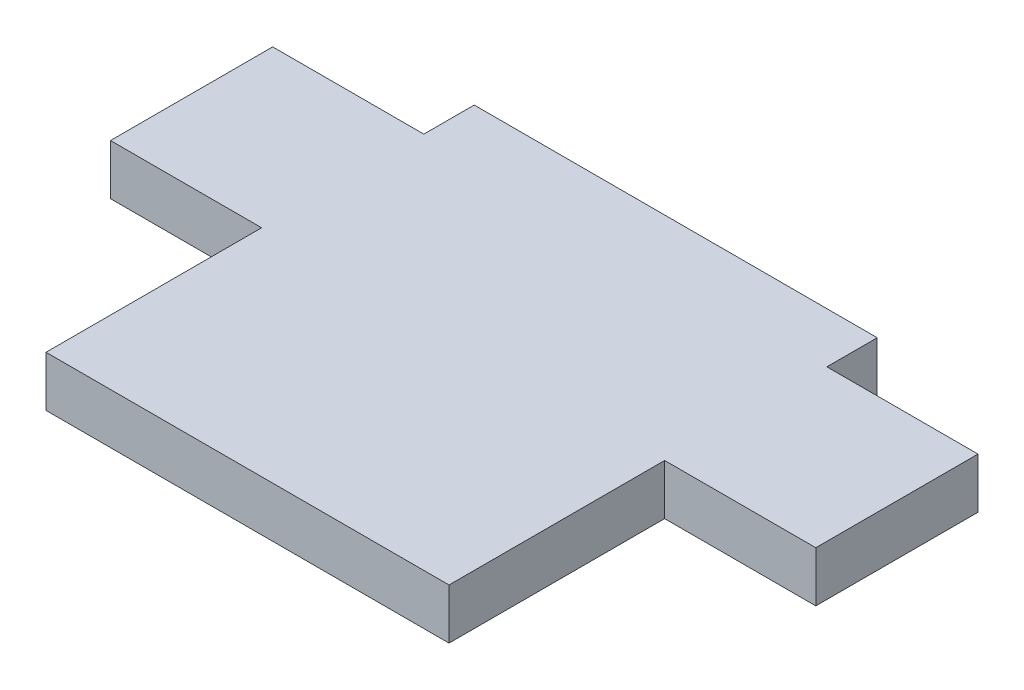
ISO-10303-21;
HEADER;
FILE_DESCRIPTION(('STEP AP214'),'2;1');
FILE_NAME('part.step','',(''),(''),'','','');
FILE_SCHEMA(('AUTOMOTIVE_DESIGN { 1 0 10303 214 1 1 1 1 }'));
ENDSEC;
DATA;
#1=APPLICATION_CONTEXT('core data for automotive mechanical design processes');
#2=APPLICATION_PROTOCOL_DEFINITION('international standard','automotive_design',2000,#1);
#3=PRODUCT_CONTEXT('',#1,'mechanical');
#4=PRODUCT('Part','Part','',(#3));
#5=PRODUCT_RELATED_PRODUCT_CATEGORY('part','',(#4));
#6=PRODUCT_DEFINITION_FORMATION('','',#4);
#7=PRODUCT_DEFINITION_CONTEXT('part definition',#1,'design');
#8=PRODUCT_DEFINITION('design','',#6,#7);
#9=PRODUCT_DEFINITION_SHAPE('','',#8);
#10=(LENGTH_UNIT() NAMED_UNIT(*) SI_UNIT(.MILLI.,.METRE.));
#11=(NAMED_UNIT(*) PLANE_ANGLE_UNIT() SI_UNIT($,.RADIAN.));
#12=(NAMED_UNIT(*) SI_UNIT($,.STERADIAN.) SOLID_ANGLE_UNIT());
#13=UNCERTAINTY_MEASURE_WITH_UNIT(LENGTH_MEASURE(1.E-05),#10,'distance_accuracy_value','');
#14=(GEOMETRIC_REPRESENTATION_CONTEXT(3) GLOBAL_UNCERTAINTY_ASSIGNED_CONTEXT((#13)) GLOBAL_UNIT_ASSIGNED_CONTEXT((#10,
#11,#12)) REPRESENTATION_CONTEXT('',''));
#15=CARTESIAN_POINT('',(0.,0.,0.));
#16=DIRECTION('',(0.,0.,1.));
#17=DIRECTION('',(1.,0.,0.));
#18=AXIS2_PLACEMENT_3D('',#15,#16,#17);
#19=CARTESIAN_POINT('',(0.,3.175,-10.2235));
#20=DIRECTION('',(-1.,0.,0.));
#21=DIRECTION('',(0.,0.,1.));
#22=AXIS2_PLACEMENT_3D('',#19,#20,#21);
#23=PLANE('',#22);
#24=DIRECTION('',(0.,0.,-1.));
#25=VECTOR('',#24,1.);
#26=CARTESIAN_POINT('',(0.,0.,-10.2235));
#27=LINE('',#26,#25);
#28=CARTESIAN_POINT('',(0.,0.,-10.2235));
#29=VERTEX_POINT('',#28);
#30=CARTESIAN_POINT('',(0.,0.,-13.3985));
#31=VERTEX_POINT('',#30);
#32=EDGE_CURVE('E155',#29,#31,#27,.T.);
#33=ORIENTED_EDGE('',*,*,#32,.T.);
#34=DIRECTION('',(0.,-1.,0.));
#35=VECTOR('',#34,1.);
#36=CARTESIAN_POINT('',(0.,3.175,-13.3985));
#37=LINE('',#36,#35);
#38=CARTESIAN_POINT('',(0.,3.175,-13.3985));
#39=VERTEX_POINT('',#38);
#40=EDGE_CURVE('E11',#39,#31,#37,.T.);
#41=ORIENTED_EDGE('',*,*,#40,.F.);
#42=DIRECTION('',(0.,0.,-1.));
#43=VECTOR('',#42,1.);
#44=CARTESIAN_POINT('',(0.,3.175,-10.2235));
#45=LINE('',#44,#43);
#46=CARTESIAN_POINT('',(0.,3.175,-10.2235));
#47=VERTEX_POINT('',#46);
#48=EDGE_CURVE('E177',#47,#39,#45,.T.);
#49=ORIENTED_EDGE('',*,*,#48,.F.);
#50=DIRECTION('',(0.,-1.,0.));
#51=VECTOR('',#50,1.);
#52=CARTESIAN_POINT('',(0.,3.175,-10.2235));
#53=LINE('',#52,#51);
#54=EDGE_CURVE('E151',#47,#29,#53,.T.);
#55=ORIENTED_EDGE('',*,*,#54,.T.);
#56=EDGE_LOOP('',(#33,#41,#49,#55));
#57=FACE_BOUND('',#56,.T.);
#58=ADVANCED_FACE('F35',(#57),#23,.F.);
#59=CARTESIAN_POINT('',(0.,3.175,-13.3985));
#60=DIRECTION('',(0.,0.,1.));
#61=DIRECTION('',(1.,0.,0.));
#62=AXIS2_PLACEMENT_3D('',#59,#60,#61);
#63=PLANE('',#62);
#64=DIRECTION('',(-1.,0.,0.));
#65=VECTOR('',#64,1.);
#66=CARTESIAN_POINT('',(0.,0.,-13.3985));
#67=LINE('',#66,#65);
#68=CARTESIAN_POINT('',(-25.4,0.,-13.3985));
#69=VERTEX_POINT('',#68);
#70=EDGE_CURVE('E158',#31,#69,#67,.T.);
#71=ORIENTED_EDGE('',*,*,#70,.T.);
#72=DIRECTION('',(0.,-1.,0.));
#73=VECTOR('',#72,1.);
#74=CARTESIAN_POINT('',(-25.4,3.175,-13.3985));
#75=LINE('',#74,#73);
#76=CARTESIAN_POINT('',(-25.4,3.175,-13.3985));
#77=VERTEX_POINT('',#76);
#78=EDGE_CURVE('E43',#77,#69,#75,.T.);
#79=ORIENTED_EDGE('',*,*,#78,.F.);
#80=DIRECTION('',(-1.,0.,0.));
#81=VECTOR('',#80,1.);
#82=CARTESIAN_POINT('',(0.,3.175,-13.3985));
#83=LINE('',#82,#81);
#84=EDGE_CURVE('E106',#39,#77,#83,.T.);
#85=ORIENTED_EDGE('',*,*,#84,.F.);
#86=ORIENTED_EDGE('',*,*,#40,.T.);
#87=EDGE_LOOP('',(#71,#79,#85,#86));
#88=FACE_BOUND('',#87,.T.);
#89=ADVANCED_FACE('F255',(#88),#63,.F.);
#90=CARTESIAN_POINT('',(-25.4,3.175,-13.3985));
#91=DIRECTION('',(1.,0.,0.));
#92=DIRECTION('',(0.,0.,-1.));
#93=AXIS2_PLACEMENT_3D('',#90,#91,#92);
#94=PLANE('',#93);
#95=DIRECTION('',(0.,0.,1.));
#96=VECTOR('',#95,1.);
#97=CARTESIAN_POINT('',(-25.4,0.,-13.3985));
#98=LINE('',#97,#96);
#99=CARTESIAN_POINT('',(-25.4,0.,-10.2235));
#100=VERTEX_POINT('',#99);
#101=EDGE_CURVE('E160',#69,#100,#98,.T.);
#102=ORIENTED_EDGE('',*,*,#101,.T.);
#103=DIRECTION('',(0.,-1.,0.));
#104=VECTOR('',#103,1.);
#105=CARTESIAN_POINT('',(-25.4,3.175,-10.2235));
#106=LINE('',#105,#104);
#107=CARTESIAN_POINT('',(-25.4,3.175,-10.2235));
#108=VERTEX_POINT('',#107);
#109=EDGE_CURVE('E196',#108,#100,#106,.T.);
#110=ORIENTED_EDGE('',*,*,#109,.F.);
#111=DIRECTION('',(0.,0.,1.));
#112=VECTOR('',#111,1.);
#113=CARTESIAN_POINT('',(-25.4,3.175,-13.3985));
#114=LINE('',#113,#112);
#115=EDGE_CURVE('E204',#77,#108,#114,.T.);
#116=ORIENTED_EDGE('',*,*,#115,.F.);
#117=ORIENTED_EDGE('',*,*,#78,.T.);
#118=EDGE_LOOP('',(#102,#110,#116,#117));
#119=FACE_BOUND('',#118,.T.);
#120=ADVANCED_FACE('F202',(#119),#94,.F.);
#121=CARTESIAN_POINT('',(-25.4,3.175,-10.2235));
#122=DIRECTION('',(0.,0.,1.));
#123=DIRECTION('',(1.,0.,0.));
#124=AXIS2_PLACEMENT_3D('',#121,#122,#123);
#125=PLANE('',#124);
#126=DIRECTION('',(-1.,0.,0.));
#127=VECTOR('',#126,1.);
#128=CARTESIAN_POINT('',(-25.4,0.,-10.2235));
#129=LINE('',#128,#127);
#130=CARTESIAN_POINT('',(-34.925,0.,-10.2235));
#131=VERTEX_POINT('',#130);
#132=EDGE_CURVE('E162',#100,#131,#129,.T.);
#133=ORIENTED_EDGE('',*,*,#132,.T.);
#134=DIRECTION('',(0.,-1.,0.));
#135=VECTOR('',#134,1.);
#136=CARTESIAN_POINT('',(-34.925,3.175,-10.2235));
#137=LINE('',#136,#135);
#138=CARTESIAN_POINT('',(-34.925,3.175,-10.2235));
#139=VERTEX_POINT('',#138);
#140=EDGE_CURVE('E193',#139,#131,#137,.T.);
#141=ORIENTED_EDGE('',*,*,#140,.F.);
#142=DIRECTION('',(-1.,0.,0.));
#143=VECTOR('',#142,1.);
#144=CARTESIAN_POINT('',(-25.4,3.175,-10.2235));
#145=LINE('',#144,#143);
#146=EDGE_CURVE('E222',#108,#139,#145,.T.);
#147=ORIENTED_EDGE('',*,*,#146,.F.);
#148=ORIENTED_EDGE('',*,*,#109,.T.);
#149=EDGE_LOOP('',(#133,#141,#147,#148));
#150=FACE_BOUND('',#149,.T.);
#151=ADVANCED_FACE('F213',(#150),#125,.F.);
#152=CARTESIAN_POINT('',(-34.925,3.175,-10.2235));
#153=DIRECTION('',(1.,0.,0.));
#154=DIRECTION('',(0.,0.,-1.));
#155=AXIS2_PLACEMENT_3D('',#152,#153,#154);
#156=PLANE('',#155);
#157=DIRECTION('',(0.,0.,1.));
#158=VECTOR('',#157,1.);
#159=CARTESIAN_POINT('',(-34.925,0.,-10.2235));
#160=LINE('',#159,#158);
#161=CARTESIAN_POINT('',(-34.925,0.,0.));
#162=VERTEX_POINT('',#161);
#163=EDGE_CURVE('E164',#131,#162,#160,.T.);
#164=ORIENTED_EDGE('',*,*,#163,.T.);
#165=DIRECTION('',(0.,-1.,0.));
#166=VECTOR('',#165,1.);
#167=CARTESIAN_POINT('',(-34.925,3.175,0.));
#168=LINE('',#167,#166);
#169=CARTESIAN_POINT('',(-34.925,3.175,0.));
#170=VERTEX_POINT('',#169);
#171=EDGE_CURVE('E190',#170,#162,#168,.T.);
#172=ORIENTED_EDGE('',*,*,#171,.F.);
#173=DIRECTION('',(0.,0.,1.));
#174=VECTOR('',#173,1.);
#175=CARTESIAN_POINT('',(-34.925,3.175,-10.2235));
#176=LINE('',#175,#174);
#177=EDGE_CURVE('E219',#139,#170,#176,.T.);
#178=ORIENTED_EDGE('',*,*,#177,.F.);
#179=ORIENTED_EDGE('',*,*,#140,.T.);
#180=EDGE_LOOP('',(#164,#172,#178,#179));
#181=FACE_BOUND('',#180,.T.);
#182=ADVANCED_FACE('F217',(#181),#156,.F.);
#183=CARTESIAN_POINT('',(-34.925,3.175,0.));
#184=DIRECTION('',(0.,0.,-1.));
#185=DIRECTION('',(-1.,0.,0.));
#186=AXIS2_PLACEMENT_3D('',#183,#184,#185);
#187=PLANE('',#186);
#188=DIRECTION('',(1.,0.,0.));
#189=VECTOR('',#188,1.);
#190=CARTESIAN_POINT('',(-34.925,0.,0.));
#191=LINE('',#190,#189);
#192=CARTESIAN_POINT('',(-25.4,0.,0.));
#193=VERTEX_POINT('',#192);
#194=EDGE_CURVE('E166',#162,#193,#191,.T.);
#195=ORIENTED_EDGE('',*,*,#194,.T.);
#196=DIRECTION('',(0.,-1.,0.));
#197=VECTOR('',#196,1.);
#198=CARTESIAN_POINT('',(-25.4,3.175,0.));
#199=LINE('',#198,#197);
#200=CARTESIAN_POINT('',(-25.4,3.175,0.));
#201=VERTEX_POINT('',#200);
#202=EDGE_CURVE('E187',#201,#193,#199,.T.);
#203=ORIENTED_EDGE('',*,*,#202,.F.);
#204=DIRECTION('',(1.,0.,0.));
#205=VECTOR('',#204,1.);
#206=CARTESIAN_POINT('',(-34.925,3.175,0.));
#207=LINE('',#206,#205);
#208=EDGE_CURVE('E221',#170,#201,#207,.T.);
#209=ORIENTED_EDGE('',*,*,#208,.F.);
#210=ORIENTED_EDGE('',*,*,#171,.T.);
#211=EDGE_LOOP('',(#195,#203,#209,#210));
#212=FACE_BOUND('',#211,.T.);
#213=ADVANCED_FACE('F268',(#212),#187,.F.);
#214=CARTESIAN_POINT('',(-25.4,3.175,0.));
#215=DIRECTION('',(1.,0.,0.));
#216=DIRECTION('',(0.,0.,-1.));
#217=AXIS2_PLACEMENT_3D('',#214,#215,#216);
#218=PLANE('',#217);
#219=DIRECTION('',(0.,0.,1.));
#220=VECTOR('',#219,1.);
#221=CARTESIAN_POINT('',(-25.4,0.,0.));
#222=LINE('',#221,#220);
#223=CARTESIAN_POINT('',(-25.4,0.,13.589));
#224=VERTEX_POINT('',#223);
#225=EDGE_CURVE('E168',#193,#224,#222,.T.);
#226=ORIENTED_EDGE('',*,*,#225,.T.);
#227=DIRECTION('',(0.,-1.,0.));
#228=VECTOR('',#227,1.);
#229=CARTESIAN_POINT('',(-25.4,3.175,13.589));
#230=LINE('',#229,#228);
#231=CARTESIAN_POINT('',(-25.4,3.175,13.589));
#232=VERTEX_POINT('',#231);
#233=EDGE_CURVE('E184',#232,#224,#230,.T.);
#234=ORIENTED_EDGE('',*,*,#233,.F.);
#235=DIRECTION('',(0.,0.,1.));
#236=VECTOR('',#235,1.);
#237=CARTESIAN_POINT('',(-25.4,3.175,0.));
#238=LINE('',#237,#236);
#239=EDGE_CURVE('E224',#201,#232,#238,.T.);
#240=ORIENTED_EDGE('',*,*,#239,.F.);
#241=ORIENTED_EDGE('',*,*,#202,.T.);
#242=EDGE_LOOP('',(#226,#234,#240,#241));
#243=FACE_BOUND('',#242,.T.);
#244=ADVANCED_FACE('F271',(#243),#218,.F.);
#245=CARTESIAN_POINT('',(-25.4,3.175,13.589));
#246=DIRECTION('',(0.,0.,-1.));
#247=DIRECTION('',(-1.,0.,0.));
#248=AXIS2_PLACEMENT_3D('',#245,#246,#247);
#249=PLANE('',#248);
#250=DIRECTION('',(1.,0.,0.));
#251=VECTOR('',#250,1.);
#252=CARTESIAN_POINT('',(-25.4,0.,13.589));
#253=LINE('',#252,#251);
#254=CARTESIAN_POINT('',(0.,0.,13.589));
#255=VERTEX_POINT('',#254);
#256=EDGE_CURVE('E170',#224,#255,#253,.T.);
#257=ORIENTED_EDGE('',*,*,#256,.T.);
#258=DIRECTION('',(0.,-1.,0.));
#259=VECTOR('',#258,1.);
#260=CARTESIAN_POINT('',(0.,3.175,13.589));
#261=LINE('',#260,#259);
#262=CARTESIAN_POINT('',(0.,3.175,13.589));
#263=VERTEX_POINT('',#262);
#264=EDGE_CURVE('E181',#263,#255,#261,.T.);
#265=ORIENTED_EDGE('',*,*,#264,.F.);
#266=DIRECTION('',(1.,0.,0.));
#267=VECTOR('',#266,1.);
#268=CARTESIAN_POINT('',(-25.4,3.175,13.589));
#269=LINE('',#268,#267);
#270=EDGE_CURVE('E230',#232,#263,#269,.T.);
#271=ORIENTED_EDGE('',*,*,#270,.F.);
#272=ORIENTED_EDGE('',*,*,#233,.T.);
#273=EDGE_LOOP('',(#257,#265,#271,#272));
#274=FACE_BOUND('',#273,.T.);
#275=ADVANCED_FACE('F236',(#274),#249,.F.);
#276=CARTESIAN_POINT('',(0.,3.175,13.589));
#277=DIRECTION('',(-1.,0.,0.));
#278=DIRECTION('',(0.,0.,1.));
#279=AXIS2_PLACEMENT_3D('',#276,#277,#278);
#280=PLANE('',#279);
#281=DIRECTION('',(0.,0.,-1.));
#282=VECTOR('',#281,1.);
#283=CARTESIAN_POINT('',(0.,0.,13.589));
#284=LINE('',#283,#282);
#285=CARTESIAN_POINT('',(0.,0.,0.));
#286=VERTEX_POINT('',#285);
#287=EDGE_CURVE('E172',#255,#286,#284,.T.);
#288=ORIENTED_EDGE('',*,*,#287,.T.);
#289=DIRECTION('',(0.,-1.,0.));
#290=VECTOR('',#289,1.);
#291=CARTESIAN_POINT('',(0.,3.175,0.));
#292=LINE('',#291,#290);
#293=CARTESIAN_POINT('',(0.,3.175,0.));
#294=VERTEX_POINT('',#293);
#295=EDGE_CURVE('E146',#294,#286,#292,.T.);
#296=ORIENTED_EDGE('',*,*,#295,.F.);
#297=DIRECTION('',(0.,0.,-1.));
#298=VECTOR('',#297,1.);
#299=CARTESIAN_POINT('',(0.,3.175,13.589));
#300=LINE('',#299,#298);
#301=EDGE_CURVE('E137',#263,#294,#300,.T.);
#302=ORIENTED_EDGE('',*,*,#301,.F.);
#303=ORIENTED_EDGE('',*,*,#264,.T.);
#304=EDGE_LOOP('',(#288,#296,#302,#303));
#305=FACE_BOUND('',#304,.T.);
#306=ADVANCED_FACE('F240',(#305),#280,.F.);
#307=CARTESIAN_POINT('',(0.,3.175,0.));
#308=DIRECTION('',(0.,0.,-1.));
#309=DIRECTION('',(-1.,0.,0.));
#310=AXIS2_PLACEMENT_3D('',#307,#308,#309);
#311=PLANE('',#310);
#312=DIRECTION('',(1.,0.,0.));
#313=VECTOR('',#312,1.);
#314=CARTESIAN_POINT('',(0.,0.,0.));
#315=LINE('',#314,#313);
#316=CARTESIAN_POINT('',(9.525,0.,0.));
#317=VERTEX_POINT('',#316);
#318=EDGE_CURVE('E145',#286,#317,#315,.T.);
#319=ORIENTED_EDGE('',*,*,#318,.T.);
#320=DIRECTION('',(0.,-1.,0.));
#321=VECTOR('',#320,1.);
#322=CARTESIAN_POINT('',(9.525,3.175,0.));
#323=LINE('',#322,#321);
#324=CARTESIAN_POINT('',(9.525,3.175,0.));
#325=VERTEX_POINT('',#324);
#326=EDGE_CURVE('E142',#325,#317,#323,.T.);
#327=ORIENTED_EDGE('',*,*,#326,.F.);
#328=DIRECTION('',(1.,0.,0.));
#329=VECTOR('',#328,1.);
#330=CARTESIAN_POINT('',(0.,3.175,0.));
#331=LINE('',#330,#329);
#332=EDGE_CURVE('E131',#294,#325,#331,.T.);
#333=ORIENTED_EDGE('',*,*,#332,.F.);
#334=ORIENTED_EDGE('',*,*,#295,.T.);
#335=EDGE_LOOP('',(#319,#327,#333,#334));
#336=FACE_BOUND('',#335,.T.);
#337=ADVANCED_FACE('F143',(#336),#311,.F.);
#338=CARTESIAN_POINT('',(9.525,3.175,0.));
#339=DIRECTION('',(-1.,0.,0.));
#340=DIRECTION('',(0.,0.,1.));
#341=AXIS2_PLACEMENT_3D('',#338,#339,#340);
#342=PLANE('',#341);
#343=DIRECTION('',(0.,0.,-1.));
#344=VECTOR('',#343,1.);
#345=CARTESIAN_POINT('',(9.525,0.,0.));
#346=LINE('',#345,#344);
#347=CARTESIAN_POINT('',(9.525,0.,-10.2235));
#348=VERTEX_POINT('',#347);
#349=EDGE_CURVE('E92',#317,#348,#346,.T.);
#350=ORIENTED_EDGE('',*,*,#349,.T.);
#351=DIRECTION('',(0.,-1.,0.));
#352=VECTOR('',#351,1.);
#353=CARTESIAN_POINT('',(9.525,3.175,-10.2235));
#354=LINE('',#353,#352);
#355=CARTESIAN_POINT('',(9.525,3.175,-10.2235));
#356=VERTEX_POINT('',#355);
#357=EDGE_CURVE('E147',#356,#348,#354,.T.);
#358=ORIENTED_EDGE('',*,*,#357,.F.);
#359=DIRECTION('',(0.,0.,-1.));
#360=VECTOR('',#359,1.);
#361=CARTESIAN_POINT('',(9.525,3.175,0.));
#362=LINE('',#361,#360);
#363=EDGE_CURVE('E135',#325,#356,#362,.T.);
#364=ORIENTED_EDGE('',*,*,#363,.F.);
#365=ORIENTED_EDGE('',*,*,#326,.T.);
#366=EDGE_LOOP('',(#350,#358,#364,#365));
#367=FACE_BOUND('',#366,.T.);
#368=ADVANCED_FACE('F149',(#367),#342,.F.);
#369=CARTESIAN_POINT('',(9.525,3.175,-10.2235));
#370=DIRECTION('',(0.,0.,1.));
#371=DIRECTION('',(1.,0.,0.));
#372=AXIS2_PLACEMENT_3D('',#369,#370,#371);
#373=PLANE('',#372);
#374=DIRECTION('',(-1.,0.,0.));
#375=VECTOR('',#374,1.);
#376=CARTESIAN_POINT('',(9.525,0.,-10.2235));
#377=LINE('',#376,#375);
#378=EDGE_CURVE('E98',#348,#29,#377,.T.);
#379=ORIENTED_EDGE('',*,*,#378,.T.);
#380=ORIENTED_EDGE('',*,*,#54,.F.);
#381=DIRECTION('',(-1.,0.,0.));
#382=VECTOR('',#381,1.);
#383=CARTESIAN_POINT('',(9.525,3.175,-10.2235));
#384=LINE('',#383,#382);
#385=EDGE_CURVE('E51',#356,#47,#384,.T.);
#386=ORIENTED_EDGE('',*,*,#385,.F.);
#387=ORIENTED_EDGE('',*,*,#357,.T.);
#388=EDGE_LOOP('',(#379,#380,#386,#387));
#389=FACE_BOUND('',#388,.T.);
#390=ADVANCED_FACE('F244',(#389),#373,.F.);
#391=CARTESIAN_POINT('',(0.,3.175,-13.3985));
#392=DIRECTION('',(0.,1.,0.));
#393=DIRECTION('',(0.,0.,1.));
#394=AXIS2_PLACEMENT_3D('',#391,#392,#393);
#395=PLANE('',#394);
#396=ORIENTED_EDGE('',*,*,#48,.T.);
#397=ORIENTED_EDGE('',*,*,#84,.T.);
#398=ORIENTED_EDGE('',*,*,#115,.T.);
#399=ORIENTED_EDGE('',*,*,#146,.T.);
#400=ORIENTED_EDGE('',*,*,#177,.T.);
#401=ORIENTED_EDGE('',*,*,#208,.T.);
#402=ORIENTED_EDGE('',*,*,#239,.T.);
#403=ORIENTED_EDGE('',*,*,#270,.T.);
#404=ORIENTED_EDGE('',*,*,#301,.T.);
#405=ORIENTED_EDGE('',*,*,#332,.T.);
#406=ORIENTED_EDGE('',*,*,#363,.T.);
#407=ORIENTED_EDGE('',*,*,#385,.T.);
#408=EDGE_LOOP('',(#396,#397,#398,#399,#400,#401,#402,#403,#404,#405,#406,#407));
#409=FACE_BOUND('',#408,.T.);
#410=ADVANCED_FACE('F133',(#409),#395,.T.);
#411=CARTESIAN_POINT('',(0.,0.,-13.3985));
#412=DIRECTION('',(0.,1.,0.));
#413=DIRECTION('',(0.,0.,1.));
#414=AXIS2_PLACEMENT_3D('',#411,#412,#413);
#415=PLANE('',#414);
#416=ORIENTED_EDGE('',*,*,#32,.F.);
#417=ORIENTED_EDGE('',*,*,#378,.F.);
#418=ORIENTED_EDGE('',*,*,#349,.F.);
#419=ORIENTED_EDGE('',*,*,#318,.F.);
#420=ORIENTED_EDGE('',*,*,#287,.F.);
#421=ORIENTED_EDGE('',*,*,#256,.F.);
#422=ORIENTED_EDGE('',*,*,#225,.F.);
#423=ORIENTED_EDGE('',*,*,#194,.F.);
#424=ORIENTED_EDGE('',*,*,#163,.F.);
#425=ORIENTED_EDGE('',*,*,#132,.F.);
#426=ORIENTED_EDGE('',*,*,#101,.F.);
#427=ORIENTED_EDGE('',*,*,#70,.F.);
#428=EDGE_LOOP('',(#416,#417,#418,#419,#420,#421,#422,#423,#424,#425,#426,#427));
#429=FACE_BOUND('',#428,.T.);
#430=ADVANCED_FACE('F208',(#429),#415,.F.);
#431=CLOSED_SHELL('',(#58,#89,#120,#151,#182,#213,#244,#275,#306,#337,#368,#390,#410,#430));
#432=MANIFOLD_SOLID_BREP('B2',#431);
#433=ADVANCED_BREP_SHAPE_REPRESENTATION('',(#18,#432),#14);
#434=SHAPE_DEFINITION_REPRESENTATION(#9,#433);
ENDSEC;
END-ISO-10303-21;
